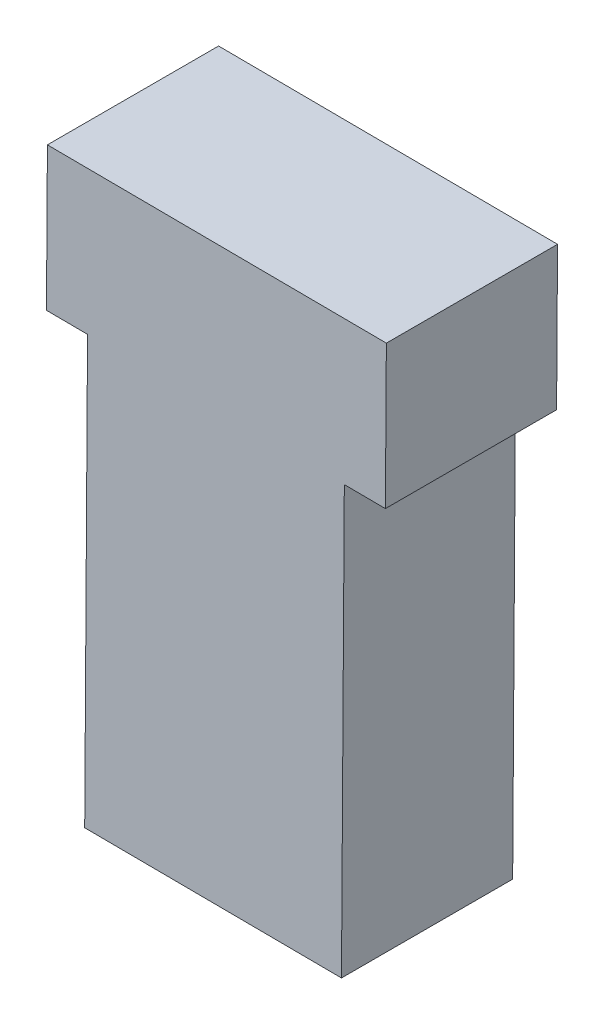
ISO-10303-21;
HEADER;
FILE_DESCRIPTION(('STEP AP214'),'2;1');
FILE_NAME('part.step','',(''),(''),'','','');
FILE_SCHEMA(('AUTOMOTIVE_DESIGN { 1 0 10303 214 1 1 1 1 }'));
ENDSEC;
DATA;
#1=APPLICATION_CONTEXT('core data for automotive mechanical design processes');
#2=APPLICATION_PROTOCOL_DEFINITION('international standard','automotive_design',2000,#1);
#3=PRODUCT_CONTEXT('',#1,'mechanical');
#4=PRODUCT('Part','Part','',(#3));
#5=PRODUCT_RELATED_PRODUCT_CATEGORY('part','',(#4));
#6=PRODUCT_DEFINITION_FORMATION('','',#4);
#7=PRODUCT_DEFINITION_CONTEXT('part definition',#1,'design');
#8=PRODUCT_DEFINITION('design','',#6,#7);
#9=PRODUCT_DEFINITION_SHAPE('','',#8);
#10=(LENGTH_UNIT() NAMED_UNIT(*) SI_UNIT(.MILLI.,.METRE.));
#11=(NAMED_UNIT(*) PLANE_ANGLE_UNIT() SI_UNIT($,.RADIAN.));
#12=(NAMED_UNIT(*) SI_UNIT($,.STERADIAN.) SOLID_ANGLE_UNIT());
#13=UNCERTAINTY_MEASURE_WITH_UNIT(LENGTH_MEASURE(1.E-05),#10,'distance_accuracy_value','');
#14=(GEOMETRIC_REPRESENTATION_CONTEXT(3) GLOBAL_UNCERTAINTY_ASSIGNED_CONTEXT((#13)) GLOBAL_UNIT_ASSIGNED_CONTEXT((#10,
#11,#12)) REPRESENTATION_CONTEXT('',''));
#15=CARTESIAN_POINT('',(0.,0.,0.));
#16=DIRECTION('',(0.,0.,1.));
#17=DIRECTION('',(1.,0.,0.));
#18=AXIS2_PLACEMENT_3D('',#15,#16,#17);
#19=CARTESIAN_POINT('',(202.481624471038,101.640363164846,143.086328634145));
#20=DIRECTION('',(0.99997801670857,-0.00663069374923689,0.));
#21=DIRECTION('',(0.,0.,-1.));
#22=AXIS2_PLACEMENT_3D('',#19,#20,#21);
#23=PLANE('',#22);
#24=DIRECTION('',(0.,0.,-1.));
#25=VECTOR('',#24,1.);
#26=CARTESIAN_POINT('',(202.47763659484,101.038949695647,142.648955771372));
#27=LINE('',#26,#25);
#28=CARTESIAN_POINT('',(202.47763659484,101.038949695647,143.651470551509));
#29=VERTEX_POINT('',#28);
#30=CARTESIAN_POINT('',(202.47763659484,101.038949695647,143.151470551509));
#31=VERTEX_POINT('',#30);
#32=EDGE_CURVE('E66',#29,#31,#27,.T.);
#33=ORIENTED_EDGE('',*,*,#32,.F.);
#34=DIRECTION('',(-0.00663069374923689,-0.999978016708569,0.));
#35=VECTOR('',#34,1.);
#36=CARTESIAN_POINT('',(202.482594373417,101.786634594926,143.651470551509));
#37=LINE('',#36,#35);
#38=CARTESIAN_POINT('',(202.469332985918,99.7866785615092,143.651470551509));
#39=VERTEX_POINT('',#38);
#40=EDGE_CURVE('E11',#29,#39,#37,.T.);
#41=ORIENTED_EDGE('',*,*,#40,.T.);
#42=DIRECTION('',(0.,0.,-1.));
#43=VECTOR('',#42,1.);
#44=CARTESIAN_POINT('',(202.469332985918,99.7866785615092,143.651470551509));
#45=LINE('',#44,#43);
#46=CARTESIAN_POINT('',(202.469332985918,99.7866785615092,143.151470551509));
#47=VERTEX_POINT('',#46);
#48=EDGE_CURVE('E54',#39,#47,#45,.T.);
#49=ORIENTED_EDGE('',*,*,#48,.T.);
#50=DIRECTION('',(0.00663069374923689,0.999978016708569,0.));
#51=VECTOR('',#50,1.);
#52=CARTESIAN_POINT('',(202.469332985918,99.7866785615092,143.151470551509));
#53=LINE('',#52,#51);
#54=EDGE_CURVE('E180',#47,#31,#53,.T.);
#55=ORIENTED_EDGE('',*,*,#54,.T.);
#56=EDGE_LOOP('',(#33,#41,#49,#55));
#57=FACE_BOUND('',#56,.T.);
#58=ADVANCED_FACE('F44',(#57),#23,.T.);
#59=CARTESIAN_POINT('',(202.469332985918,99.7866785615092,143.651470551509));
#60=DIRECTION('',(-0.00663069374923689,-0.99997801670857,0.));
#61=DIRECTION('',(-0.99997801670857,0.00663069374923689,0.));
#62=AXIS2_PLACEMENT_3D('',#59,#60,#61);
#63=PLANE('',#62);
#64=DIRECTION('',(-0.999978016708569,0.00663069374923689,0.));
#65=VECTOR('',#64,1.);
#66=CARTESIAN_POINT('',(202.469332985918,99.7866785615092,143.651470551509));
#67=LINE('',#66,#65);
#68=CARTESIAN_POINT('',(201.719349473387,99.7916515818211,143.651470551509));
#69=VERTEX_POINT('',#68);
#70=EDGE_CURVE('E208',#39,#69,#67,.T.);
#71=ORIENTED_EDGE('',*,*,#70,.T.);
#72=DIRECTION('',(0.,0.,-1.));
#73=VECTOR('',#72,1.);
#74=CARTESIAN_POINT('',(201.719349473387,99.7916515818211,143.651470551509));
#75=LINE('',#74,#73);
#76=CARTESIAN_POINT('',(201.719349473387,99.7916515818211,143.151470551509));
#77=VERTEX_POINT('',#76);
#78=EDGE_CURVE('E203',#69,#77,#75,.T.);
#79=ORIENTED_EDGE('',*,*,#78,.T.);
#80=DIRECTION('',(-0.999978016708569,0.00663069374923689,0.));
#81=VECTOR('',#80,1.);
#82=CARTESIAN_POINT('',(202.469332985918,99.7866785615092,143.151470551509));
#83=LINE('',#82,#81);
#84=EDGE_CURVE('E112',#47,#77,#83,.T.);
#85=ORIENTED_EDGE('',*,*,#84,.F.);
#86=ORIENTED_EDGE('',*,*,#48,.F.);
#87=EDGE_LOOP('',(#71,#79,#85,#86));
#88=FACE_BOUND('',#87,.T.);
#89=ADVANCED_FACE('F236',(#88),#63,.T.);
#90=CARTESIAN_POINT('',(201.731640958507,101.645336185158,143.086328634145));
#91=DIRECTION('',(0.99997801670857,-0.00663069374923689,0.));
#92=DIRECTION('',(0.,0.,-1.));
#93=AXIS2_PLACEMENT_3D('',#90,#91,#92);
#94=PLANE('',#93);
#95=DIRECTION('',(0.00663069374923689,0.999978016708569,0.));
#96=VECTOR('',#95,1.);
#97=CARTESIAN_POINT('',(201.719349473387,99.7916515818211,143.151470551509));
#98=LINE('',#97,#96);
#99=CARTESIAN_POINT('',(201.727653082309,101.043922715959,143.151470551509));
#100=VERTEX_POINT('',#99);
#101=EDGE_CURVE('E174',#77,#100,#98,.T.);
#102=ORIENTED_EDGE('',*,*,#101,.F.);
#103=ORIENTED_EDGE('',*,*,#78,.F.);
#104=DIRECTION('',(-0.00663069374923689,-0.999978016708569,0.));
#105=VECTOR('',#104,1.);
#106=CARTESIAN_POINT('',(201.732610860885,101.791607615238,143.651470551509));
#107=LINE('',#106,#105);
#108=CARTESIAN_POINT('',(201.727653082309,101.043922715959,143.651470551509));
#109=VERTEX_POINT('',#108);
#110=EDGE_CURVE('E121',#109,#69,#107,.T.);
#111=ORIENTED_EDGE('',*,*,#110,.F.);
#112=DIRECTION('',(0.,0.,-1.));
#113=VECTOR('',#112,1.);
#114=CARTESIAN_POINT('',(201.727653082309,101.043922715959,142.648955771372));
#115=LINE('',#114,#113);
#116=EDGE_CURVE('E200',#109,#100,#115,.T.);
#117=ORIENTED_EDGE('',*,*,#116,.T.);
#118=EDGE_LOOP('',(#102,#103,#111,#117));
#119=FACE_BOUND('',#118,.T.);
#120=ADVANCED_FACE('F238',(#119),#94,.F.);
#121=CARTESIAN_POINT('',(205.352573392878,101.019886451118,142.211582908599));
#122=DIRECTION('',(-0.00663069374923689,-0.99997801670857,0.));
#123=DIRECTION('',(-0.99997801670857,0.00663069374923689,0.));
#124=AXIS2_PLACEMENT_3D('',#121,#122,#123);
#125=PLANE('',#124);
#126=ORIENTED_EDGE('',*,*,#116,.F.);
#127=DIRECTION('',(0.999978016708569,-0.00663069374923689,0.));
#128=VECTOR('',#127,1.);
#129=CARTESIAN_POINT('',(203.975103674861,101.029020231757,143.651470551509));
#130=LINE('',#129,#128);
#131=CARTESIAN_POINT('',(201.607655720304,101.044718399208,143.651470551509));
#132=VERTEX_POINT('',#131);
#133=EDGE_CURVE('E204',#132,#109,#130,.T.);
#134=ORIENTED_EDGE('',*,*,#133,.F.);
#135=DIRECTION('',(0.,0.,-1.));
#136=VECTOR('',#135,1.);
#137=CARTESIAN_POINT('',(201.607655720304,101.044718399208,142.648955771372));
#138=LINE('',#137,#136);
#139=CARTESIAN_POINT('',(201.607655720304,101.044718399208,143.151470551509));
#140=VERTEX_POINT('',#139);
#141=EDGE_CURVE('E195',#132,#140,#138,.T.);
#142=ORIENTED_EDGE('',*,*,#141,.T.);
#143=DIRECTION('',(-0.999978016708569,0.00663069374923689,0.));
#144=VECTOR('',#143,1.);
#145=CARTESIAN_POINT('',(203.975103674861,101.029020231757,143.151470551509));
#146=LINE('',#145,#144);
#147=EDGE_CURVE('E173',#100,#140,#146,.T.);
#148=ORIENTED_EDGE('',*,*,#147,.F.);
#149=EDGE_LOOP('',(#126,#134,#142,#148));
#150=FACE_BOUND('',#149,.T.);
#151=ADVANCED_FACE('F228',(#150),#125,.T.);
#152=CARTESIAN_POINT('',(201.611643596501,101.646131868408,143.086328634145));
#153=DIRECTION('',(0.99997801670857,-0.00663069374923689,0.));
#154=DIRECTION('',(0.,0.,-1.));
#155=AXIS2_PLACEMENT_3D('',#152,#153,#154);
#156=PLANE('',#155);
#157=ORIENTED_EDGE('',*,*,#141,.F.);
#158=DIRECTION('',(-0.00663069374923689,-0.999978016708569,0.));
#159=VECTOR('',#158,1.);
#160=CARTESIAN_POINT('',(201.61261349888,101.792403298488,143.651470551509));
#161=LINE('',#160,#159);
#162=CARTESIAN_POINT('',(201.610440611678,101.464709166226,143.651470551509));
#163=VERTEX_POINT('',#162);
#164=EDGE_CURVE('E47',#163,#132,#161,.T.);
#165=ORIENTED_EDGE('',*,*,#164,.F.);
#166=DIRECTION('',(0.,0.,1.));
#167=VECTOR('',#166,1.);
#168=CARTESIAN_POINT('',(201.610440611678,101.464709166226,142.211582908599));
#169=LINE('',#168,#167);
#170=CARTESIAN_POINT('',(201.610440611678,101.464709166226,143.151470551509));
#171=VERTEX_POINT('',#170);
#172=EDGE_CURVE('E193',#171,#163,#169,.T.);
#173=ORIENTED_EDGE('',*,*,#172,.F.);
#174=DIRECTION('',(0.00663069374923689,0.999978016708569,0.));
#175=VECTOR('',#174,1.);
#176=CARTESIAN_POINT('',(201.599352111382,99.792447265071,143.151470551509));
#177=LINE('',#176,#175);
#178=EDGE_CURVE('E157',#140,#171,#177,.T.);
#179=ORIENTED_EDGE('',*,*,#178,.F.);
#180=EDGE_LOOP('',(#157,#165,#173,#179));
#181=FACE_BOUND('',#180,.T.);
#182=ADVANCED_FACE('F231',(#181),#156,.F.);
#183=CARTESIAN_POINT('',(201.610440611678,101.464709166226,142.211582908599));
#184=DIRECTION('',(0.00663069374923689,0.99997801670857,0.));
#185=DIRECTION('',(0.,0.,-1.));
#186=AXIS2_PLACEMENT_3D('',#183,#184,#185);
#187=PLANE('',#186);
#188=DIRECTION('',(0.999978016708569,-0.00663069374923689,0.));
#189=VECTOR('',#188,1.);
#190=CARTESIAN_POINT('',(202.105429729949,101.46142697282,143.151470551509));
#191=LINE('',#190,#189);
#192=CARTESIAN_POINT('',(202.60041884822,101.458144779414,143.151470551509));
#193=VERTEX_POINT('',#192);
#194=EDGE_CURVE('E146',#171,#193,#191,.T.);
#195=ORIENTED_EDGE('',*,*,#194,.F.);
#196=ORIENTED_EDGE('',*,*,#172,.T.);
#197=DIRECTION('',(-0.999978016708569,0.00663069374923689,0.));
#198=VECTOR('',#197,1.);
#199=CARTESIAN_POINT('',(202.105429729949,101.46142697282,143.651470551509));
#200=LINE('',#199,#198);
#201=CARTESIAN_POINT('',(202.60041884822,101.458144779414,143.651470551509));
#202=VERTEX_POINT('',#201);
#203=EDGE_CURVE('E148',#202,#163,#200,.T.);
#204=ORIENTED_EDGE('',*,*,#203,.F.);
#205=DIRECTION('',(0.,0.,1.));
#206=VECTOR('',#205,1.);
#207=CARTESIAN_POINT('',(202.60041884822,101.458144779414,142.211582908599));
#208=LINE('',#207,#206);
#209=EDGE_CURVE('E142',#193,#202,#208,.T.);
#210=ORIENTED_EDGE('',*,*,#209,.F.);
#211=EDGE_LOOP('',(#195,#196,#204,#210));
#212=FACE_BOUND('',#211,.T.);
#213=ADVANCED_FACE('F144',(#212),#187,.T.);
#214=CARTESIAN_POINT('',(202.602591735421,101.785838911676,143.651470551509));
#215=DIRECTION('',(0.,0.,1.));
#216=DIRECTION('',(1.,0.,0.));
#217=AXIS2_PLACEMENT_3D('',#214,#215,#216);
#218=PLANE('',#217);
#219=DIRECTION('',(-0.00663069374923689,-0.999978016708569,0.));
#220=VECTOR('',#219,1.);
#221=CARTESIAN_POINT('',(202.602591735421,101.785838911676,143.651470551509));
#222=LINE('',#221,#220);
#223=CARTESIAN_POINT('',(202.597633956845,101.038154012397,143.651470551509));
#224=VERTEX_POINT('',#223);
#225=EDGE_CURVE('E135',#202,#224,#222,.T.);
#226=ORIENTED_EDGE('',*,*,#225,.F.);
#227=ORIENTED_EDGE('',*,*,#203,.T.);
#228=ORIENTED_EDGE('',*,*,#164,.T.);
#229=ORIENTED_EDGE('',*,*,#133,.T.);
#230=ORIENTED_EDGE('',*,*,#110,.T.);
#231=ORIENTED_EDGE('',*,*,#70,.F.);
#232=ORIENTED_EDGE('',*,*,#40,.F.);
#233=DIRECTION('',(0.999978016708569,-0.00663069374923689,0.));
#234=VECTOR('',#233,1.);
#235=CARTESIAN_POINT('',(203.975103674861,101.029020231757,143.651470551509));
#236=LINE('',#235,#234);
#237=EDGE_CURVE('E183',#29,#224,#236,.T.);
#238=ORIENTED_EDGE('',*,*,#237,.T.);
#239=EDGE_LOOP('',(#226,#227,#228,#229,#230,#231,#232,#238));
#240=FACE_BOUND('',#239,.T.);
#241=ADVANCED_FACE('F224',(#240),#218,.T.);
#242=CARTESIAN_POINT('',(205.352573392878,101.019886451118,142.211582908599));
#243=DIRECTION('',(-0.00663069374923689,-0.99997801670857,0.));
#244=DIRECTION('',(-0.99997801670857,0.00663069374923689,0.));
#245=AXIS2_PLACEMENT_3D('',#242,#243,#244);
#246=PLANE('',#245);
#247=DIRECTION('',(0.,0.,-1.));
#248=VECTOR('',#247,1.);
#249=CARTESIAN_POINT('',(202.597633956845,101.038154012397,142.648955771372));
#250=LINE('',#249,#248);
#251=CARTESIAN_POINT('',(202.597633956845,101.038154012397,143.151470551509));
#252=VERTEX_POINT('',#251);
#253=EDGE_CURVE('E163',#224,#252,#250,.T.);
#254=ORIENTED_EDGE('',*,*,#253,.F.);
#255=ORIENTED_EDGE('',*,*,#237,.F.);
#256=ORIENTED_EDGE('',*,*,#32,.T.);
#257=DIRECTION('',(-0.999978016708569,0.00663069374923689,0.));
#258=VECTOR('',#257,1.);
#259=CARTESIAN_POINT('',(203.975103674861,101.029020231757,143.151470551509));
#260=LINE('',#259,#258);
#261=EDGE_CURVE('E186',#252,#31,#260,.T.);
#262=ORIENTED_EDGE('',*,*,#261,.F.);
#263=EDGE_LOOP('',(#254,#255,#256,#262));
#264=FACE_BOUND('',#263,.T.);
#265=ADVANCED_FACE('F234',(#264),#246,.T.);
#266=CARTESIAN_POINT('',(202.589330347923,99.7858828782592,143.151470551509));
#267=DIRECTION('',(0.,0.,-1.));
#268=DIRECTION('',(-1.,0.,0.));
#269=AXIS2_PLACEMENT_3D('',#266,#267,#268);
#270=PLANE('',#269);
#271=DIRECTION('',(0.00663069374923689,0.999978016708569,0.));
#272=VECTOR('',#271,1.);
#273=CARTESIAN_POINT('',(202.589330347923,99.7858828782592,143.151470551509));
#274=LINE('',#273,#272);
#275=EDGE_CURVE('E151',#252,#193,#274,.T.);
#276=ORIENTED_EDGE('',*,*,#275,.F.);
#277=ORIENTED_EDGE('',*,*,#261,.T.);
#278=ORIENTED_EDGE('',*,*,#54,.F.);
#279=ORIENTED_EDGE('',*,*,#84,.T.);
#280=ORIENTED_EDGE('',*,*,#101,.T.);
#281=ORIENTED_EDGE('',*,*,#147,.T.);
#282=ORIENTED_EDGE('',*,*,#178,.T.);
#283=ORIENTED_EDGE('',*,*,#194,.T.);
#284=EDGE_LOOP('',(#276,#277,#278,#279,#280,#281,#282,#283));
#285=FACE_BOUND('',#284,.T.);
#286=ADVANCED_FACE('F154',(#285),#270,.T.);
#287=CARTESIAN_POINT('',(202.601621833043,101.639567481597,143.086328634145));
#288=DIRECTION('',(0.99997801670857,-0.00663069374923689,0.));
#289=DIRECTION('',(0.,0.,-1.));
#290=AXIS2_PLACEMENT_3D('',#287,#288,#289);
#291=PLANE('',#290);
#292=ORIENTED_EDGE('',*,*,#275,.T.);
#293=ORIENTED_EDGE('',*,*,#209,.T.);
#294=ORIENTED_EDGE('',*,*,#225,.T.);
#295=ORIENTED_EDGE('',*,*,#253,.T.);
#296=EDGE_LOOP('',(#292,#293,#294,#295));
#297=FACE_BOUND('',#296,.T.);
#298=ADVANCED_FACE('F161',(#297),#291,.T.);
#299=CLOSED_SHELL('',(#58,#89,#120,#151,#182,#213,#241,#265,#286,#298));
#300=MANIFOLD_SOLID_BREP('B2',#299);
#301=ADVANCED_BREP_SHAPE_REPRESENTATION('',(#18,#300),#14);
#302=SHAPE_DEFINITION_REPRESENTATION(#9,#301);
ENDSEC;
END-ISO-10303-21;
